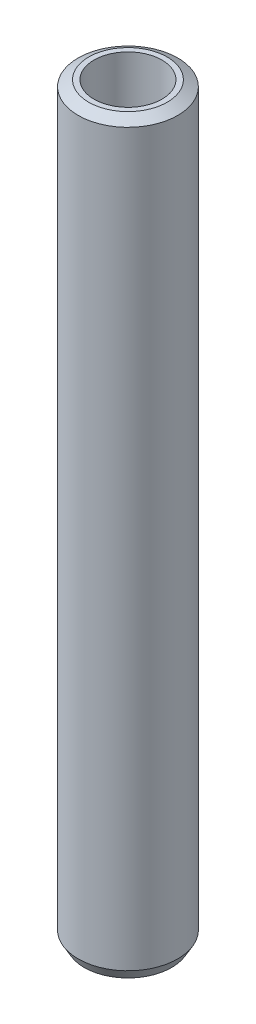
ISO-10303-21;
HEADER;
FILE_DESCRIPTION(('STEP AP214'),'2;1');
FILE_NAME('part.step','',(''),(''),'','','');
FILE_SCHEMA(('AUTOMOTIVE_DESIGN { 1 0 10303 214 1 1 1 1 }'));
ENDSEC;
DATA;
#1=APPLICATION_CONTEXT('core data for automotive mechanical design processes');
#2=APPLICATION_PROTOCOL_DEFINITION('international standard','automotive_design',2000,#1);
#3=PRODUCT_CONTEXT('',#1,'mechanical');
#4=PRODUCT('Part','Part','',(#3));
#5=PRODUCT_RELATED_PRODUCT_CATEGORY('part','',(#4));
#6=PRODUCT_DEFINITION_FORMATION('','',#4);
#7=PRODUCT_DEFINITION_CONTEXT('part definition',#1,'design');
#8=PRODUCT_DEFINITION('design','',#6,#7);
#9=PRODUCT_DEFINITION_SHAPE('','',#8);
#10=(LENGTH_UNIT() NAMED_UNIT(*) SI_UNIT(.MILLI.,.METRE.));
#11=(NAMED_UNIT(*) PLANE_ANGLE_UNIT() SI_UNIT($,.RADIAN.));
#12=(NAMED_UNIT(*) SI_UNIT($,.STERADIAN.) SOLID_ANGLE_UNIT());
#13=UNCERTAINTY_MEASURE_WITH_UNIT(LENGTH_MEASURE(1.E-05),#10,'distance_accuracy_value','');
#14=(GEOMETRIC_REPRESENTATION_CONTEXT(3) GLOBAL_UNCERTAINTY_ASSIGNED_CONTEXT((#13)) GLOBAL_UNIT_ASSIGNED_CONTEXT((#10,
#11,#12)) REPRESENTATION_CONTEXT('',''));
#15=CARTESIAN_POINT('',(0.,0.,0.));
#16=DIRECTION('',(0.,0.,1.));
#17=DIRECTION('',(1.,0.,0.));
#18=AXIS2_PLACEMENT_3D('',#15,#16,#17);
#19=CARTESIAN_POINT('',(0.,600.,0.));
#20=DIRECTION('',(0.,-1.,0.));
#21=DIRECTION('',(0.,0.,-1.));
#22=AXIS2_PLACEMENT_3D('',#19,#20,#21);
#23=CYLINDRICAL_SURFACE('',#22,40.);
#24=CARTESIAN_POINT('',(0.,595.093231409545,0.));
#25=DIRECTION('',(0.,1.,0.));
#26=DIRECTION('',(0.,0.,1.));
#27=AXIS2_PLACEMENT_3D('',#24,#25,#26);
#28=CIRCLE('',#27,40.);
#29=CARTESIAN_POINT('',(0.,595.093231409545,40.));
#30=VERTEX_POINT('',#29);
#31=EDGE_CURVE('E50',#30,#30,#28,.F.);
#32=ORIENTED_EDGE('',*,*,#31,.T.);
#33=EDGE_LOOP('',(#32));
#34=FACE_BOUND('',#33,.T.);
#35=CARTESIAN_POINT('',(0.,8.49877249965159,0.));
#36=DIRECTION('',(0.,1.,0.));
#37=DIRECTION('',(0.,0.,1.));
#38=AXIS2_PLACEMENT_3D('',#35,#36,#37);
#39=CIRCLE('',#38,40.);
#40=CARTESIAN_POINT('',(0.,8.49877249965159,40.));
#41=VERTEX_POINT('',#40);
#42=EDGE_CURVE('E51',#41,#41,#39,.T.);
#43=ORIENTED_EDGE('',*,*,#42,.T.);
#44=EDGE_LOOP('',(#43));
#45=FACE_BOUND('',#44,.T.);
#46=ADVANCED_FACE('F39',(#34,#45),#23,.T.);
#47=CARTESIAN_POINT('',(0.,600.,0.));
#48=DIRECTION('',(0.,1.,0.));
#49=DIRECTION('',(0.,0.,1.));
#50=AXIS2_PLACEMENT_3D('',#47,#48,#49);
#51=PLANE('',#50);
#52=CARTESIAN_POINT('',(0.,600.,0.));
#53=DIRECTION('',(0.,1.,0.));
#54=DIRECTION('',(0.,0.,1.));
#55=AXIS2_PLACEMENT_3D('',#52,#53,#54);
#56=CIRCLE('',#55,31.5012275003484);
#57=CARTESIAN_POINT('',(0.,600.,31.5012275003484));
#58=VERTEX_POINT('',#57);
#59=EDGE_CURVE('E54',#58,#58,#56,.T.);
#60=ORIENTED_EDGE('',*,*,#59,.T.);
#61=EDGE_LOOP('',(#60));
#62=FACE_BOUND('',#61,.T.);
#63=CARTESIAN_POINT('',(0.,600.,0.));
#64=DIRECTION('',(0.,1.,0.));
#65=DIRECTION('',(0.,0.,1.));
#66=AXIS2_PLACEMENT_3D('',#63,#64,#65);
#67=CIRCLE('',#66,27.2857258907619);
#68=CARTESIAN_POINT('',(0.,600.,27.2857258907619));
#69=VERTEX_POINT('',#68);
#70=EDGE_CURVE('E58',#69,#69,#67,.T.);
#71=ORIENTED_EDGE('',*,*,#70,.F.);
#72=EDGE_LOOP('',(#71));
#73=FACE_BOUND('',#72,.T.);
#74=ADVANCED_FACE('F69',(#62,#73),#51,.T.);
#75=CARTESIAN_POINT('',(0.,0.,0.));
#76=DIRECTION('',(0.,1.,0.));
#77=DIRECTION('',(0.,0.,1.));
#78=AXIS2_PLACEMENT_3D('',#75,#76,#77);
#79=PLANE('',#78);
#80=CARTESIAN_POINT('',(0.,0.,0.));
#81=DIRECTION('',(0.,1.,0.));
#82=DIRECTION('',(0.,0.,1.));
#83=AXIS2_PLACEMENT_3D('',#80,#81,#82);
#84=CIRCLE('',#83,35.0932314095447);
#85=CARTESIAN_POINT('',(0.,0.,35.0932314095447));
#86=VERTEX_POINT('',#85);
#87=EDGE_CURVE('E10',#86,#86,#84,.F.);
#88=ORIENTED_EDGE('',*,*,#87,.T.);
#89=EDGE_LOOP('',(#88));
#90=FACE_BOUND('',#89,.T.);
#91=CARTESIAN_POINT('',(0.,0.,0.));
#92=DIRECTION('',(0.,1.,0.));
#93=DIRECTION('',(0.,0.,1.));
#94=AXIS2_PLACEMENT_3D('',#91,#92,#93);
#95=CIRCLE('',#94,27.2857258907619);
#96=CARTESIAN_POINT('',(0.,0.,27.2857258907619));
#97=VERTEX_POINT('',#96);
#98=EDGE_CURVE('E63',#97,#97,#95,.T.);
#99=ORIENTED_EDGE('',*,*,#98,.T.);
#100=EDGE_LOOP('',(#99));
#101=FACE_BOUND('',#100,.T.);
#102=ADVANCED_FACE('F75',(#90,#101),#79,.F.);
#103=CARTESIAN_POINT('',(0.,600.,0.));
#104=DIRECTION('',(0.,-1.,0.));
#105=DIRECTION('',(0.,0.,-1.));
#106=AXIS2_PLACEMENT_3D('',#103,#104,#105);
#107=CYLINDRICAL_SURFACE('',#106,27.2857258907619);
#108=ORIENTED_EDGE('',*,*,#70,.T.);
#109=EDGE_LOOP('',(#108));
#110=FACE_BOUND('',#109,.T.);
#111=ORIENTED_EDGE('',*,*,#98,.F.);
#112=EDGE_LOOP('',(#111));
#113=FACE_BOUND('',#112,.T.);
#114=ADVANCED_FACE('F70',(#110,#113),#107,.F.);
#115=CARTESIAN_POINT('',(0.,600.,0.));
#116=DIRECTION('',(0.,-1.,0.));
#117=DIRECTION('',(0.,0.,-1.));
#118=AXIS2_PLACEMENT_3D('',#115,#116,#117);
#119=CONICAL_SURFACE('',#118,31.5012275003484,1.04719755119659);
#120=ORIENTED_EDGE('',*,*,#31,.F.);
#121=EDGE_LOOP('',(#120));
#122=FACE_BOUND('',#121,.T.);
#123=ORIENTED_EDGE('',*,*,#59,.F.);
#124=EDGE_LOOP('',(#123));
#125=FACE_BOUND('',#124,.T.);
#126=ADVANCED_FACE('F81',(#122,#125),#119,.T.);
#127=CARTESIAN_POINT('',(0.,8.49877249965159,0.));
#128=DIRECTION('',(0.,1.,0.));
#129=DIRECTION('',(0.,0.,1.));
#130=AXIS2_PLACEMENT_3D('',#127,#128,#129);
#131=CONICAL_SURFACE('',#130,40.,0.523598775598302);
#132=ORIENTED_EDGE('',*,*,#87,.F.);
#133=EDGE_LOOP('',(#132));
#134=FACE_BOUND('',#133,.T.);
#135=ORIENTED_EDGE('',*,*,#42,.F.);
#136=EDGE_LOOP('',(#135));
#137=FACE_BOUND('',#136,.T.);
#138=ADVANCED_FACE('F45',(#134,#137),#131,.T.);
#139=CLOSED_SHELL('',(#46,#74,#102,#114,#126,#138));
#140=MANIFOLD_SOLID_BREP('B2',#139);
#141=ADVANCED_BREP_SHAPE_REPRESENTATION('',(#18,#140),#14);
#142=SHAPE_DEFINITION_REPRESENTATION(#9,#141);
ENDSEC;
END-ISO-10303-21;
